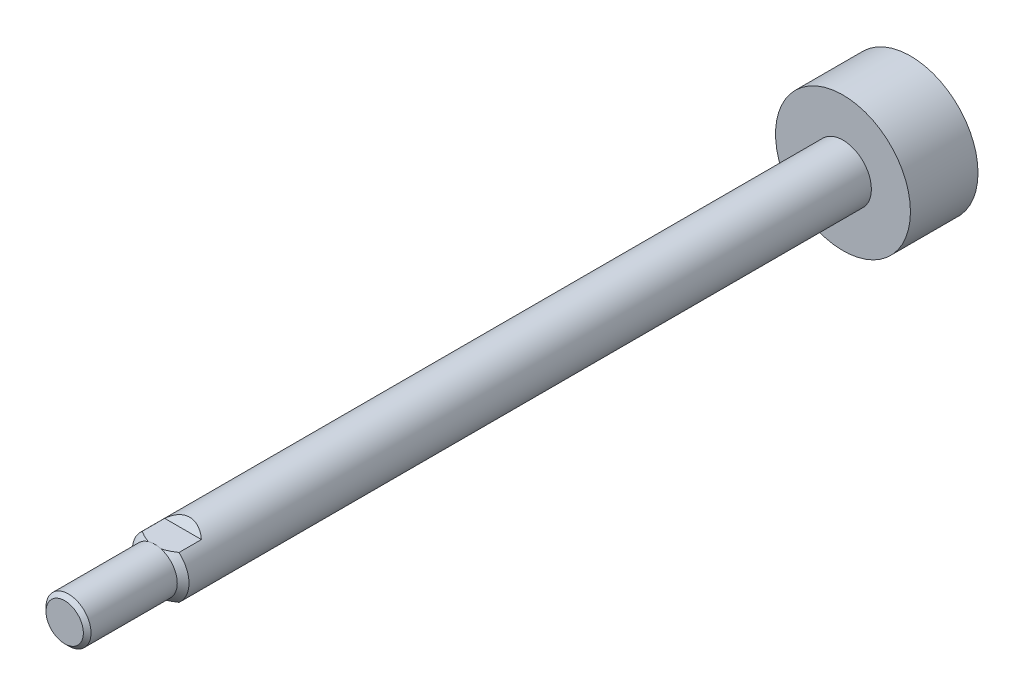
ISO-10303-21;
HEADER;
FILE_DESCRIPTION(('STEP AP214'),'2;1');
FILE_NAME('part.step','',(''),(''),'','','');
FILE_SCHEMA(('AUTOMOTIVE_DESIGN { 1 0 10303 214 1 1 1 1 }'));
ENDSEC;
DATA;
#1=APPLICATION_CONTEXT('core data for automotive mechanical design processes');
#2=APPLICATION_PROTOCOL_DEFINITION('international standard','automotive_design',2000,#1);
#3=PRODUCT_CONTEXT('',#1,'mechanical');
#4=PRODUCT('Part','Part','',(#3));
#5=PRODUCT_RELATED_PRODUCT_CATEGORY('part','',(#4));
#6=PRODUCT_DEFINITION_FORMATION('','',#4);
#7=PRODUCT_DEFINITION_CONTEXT('part definition',#1,'design');
#8=PRODUCT_DEFINITION('design','',#6,#7);
#9=PRODUCT_DEFINITION_SHAPE('','',#8);
#10=(LENGTH_UNIT() NAMED_UNIT(*) SI_UNIT(.MILLI.,.METRE.));
#11=(NAMED_UNIT(*) PLANE_ANGLE_UNIT() SI_UNIT($,.RADIAN.));
#12=(NAMED_UNIT(*) SI_UNIT($,.STERADIAN.) SOLID_ANGLE_UNIT());
#13=UNCERTAINTY_MEASURE_WITH_UNIT(LENGTH_MEASURE(1.E-05),#10,'distance_accuracy_value','');
#14=(GEOMETRIC_REPRESENTATION_CONTEXT(3) GLOBAL_UNCERTAINTY_ASSIGNED_CONTEXT((#13)) GLOBAL_UNIT_ASSIGNED_CONTEXT((#10,
#11,#12)) REPRESENTATION_CONTEXT('',''));
#15=CARTESIAN_POINT('',(0.,0.,0.));
#16=DIRECTION('',(0.,0.,1.));
#17=DIRECTION('',(1.,0.,0.));
#18=AXIS2_PLACEMENT_3D('',#15,#16,#17);
#19=CARTESIAN_POINT('',(0.,0.,12.7));
#20=DIRECTION('',(0.,0.,-1.));
#21=DIRECTION('',(-1.,0.,0.));
#22=AXIS2_PLACEMENT_3D('',#19,#20,#21);
#23=PLANE('',#22);
#24=CARTESIAN_POINT('',(0.,0.,12.6999999999384));
#25=DIRECTION('',(0.,0.,-1.));
#26=DIRECTION('',(-1.,0.,0.));
#27=AXIS2_PLACEMENT_3D('',#24,#25,#26);
#28=CIRCLE('',#27,2.63398000004145);
#29=CARTESIAN_POINT('',(-2.63398000004145,0.,12.6999999999384));
#30=VERTEX_POINT('',#29);
#31=EDGE_CURVE('E26',#30,#30,#28,.T.);
#32=ORIENTED_EDGE('',*,*,#31,.F.);
#33=EDGE_LOOP('',(#32));
#34=FACE_BOUND('',#33,.T.);
#35=ADVANCED_FACE('F23',(#34),#23,.F.);
#36=CARTESIAN_POINT('',(0.,9.5123,-106.57205));
#37=DIRECTION('',(0.,0.,1.));
#38=DIRECTION('',(1.,0.,0.));
#39=AXIS2_PLACEMENT_3D('',#36,#37,#38);
#40=PLANE('',#39);
#41=CARTESIAN_POINT('',(0.,0.,-106.57205));
#42=DIRECTION('',(0.,0.,1.));
#43=DIRECTION('',(1.,0.,0.));
#44=AXIS2_PLACEMENT_3D('',#41,#42,#43);
#45=CIRCLE('',#44,9.5123);
#46=CARTESIAN_POINT('',(9.5123,0.,-106.57205));
#47=VERTEX_POINT('',#46);
#48=EDGE_CURVE('E85',#47,#47,#45,.T.);
#49=ORIENTED_EDGE('',*,*,#48,.F.);
#50=EDGE_LOOP('',(#49));
#51=FACE_BOUND('',#50,.T.);
#52=ADVANCED_FACE('F214',(#51),#40,.F.);
#53=CARTESIAN_POINT('',(0.,0.,12.1589800000379));
#54=DIRECTION('',(0.,0.,-1.));
#55=DIRECTION('',(-1.,0.,0.));
#56=AXIS2_PLACEMENT_3D('',#53,#54,#55);
#57=CONICAL_SURFACE('',#56,3.17499999994197,0.785398163397448);
#58=ORIENTED_EDGE('',*,*,#31,.T.);
#59=EDGE_LOOP('',(#58));
#60=FACE_BOUND('',#59,.T.);
#61=CARTESIAN_POINT('',(0.,0.,12.15898));
#62=DIRECTION('',(0.,0.,1.));
#63=DIRECTION('',(1.,0.,0.));
#64=AXIS2_PLACEMENT_3D('',#61,#62,#63);
#65=CIRCLE('',#64,3.175);
#66=CARTESIAN_POINT('',(3.175,0.,12.15898));
#67=VERTEX_POINT('',#66);
#68=EDGE_CURVE('E84',#67,#67,#65,.F.);
#69=ORIENTED_EDGE('',*,*,#68,.F.);
#70=EDGE_LOOP('',(#69));
#71=FACE_BOUND('',#70,.T.);
#72=ADVANCED_FACE('F210',(#60,#71),#57,.T.);
#73=CARTESIAN_POINT('',(0.,0.,-106.57205));
#74=DIRECTION('',(0.,0.,1.));
#75=DIRECTION('',(1.,0.,0.));
#76=AXIS2_PLACEMENT_3D('',#73,#74,#75);
#77=CYLINDRICAL_SURFACE('',#76,9.5123);
#78=CARTESIAN_POINT('',(0.,0.,-97.04705));
#79=DIRECTION('',(0.,0.,1.));
#80=DIRECTION('',(1.,0.,0.));
#81=AXIS2_PLACEMENT_3D('',#78,#79,#80);
#82=CIRCLE('',#81,9.5123);
#83=CARTESIAN_POINT('',(9.5123,0.,-97.04705));
#84=VERTEX_POINT('',#83);
#85=EDGE_CURVE('E96',#84,#84,#82,.F.);
#86=ORIENTED_EDGE('',*,*,#85,.T.);
#87=EDGE_LOOP('',(#86));
#88=FACE_BOUND('',#87,.T.);
#89=ORIENTED_EDGE('',*,*,#48,.T.);
#90=EDGE_LOOP('',(#89));
#91=FACE_BOUND('',#90,.T.);
#92=ADVANCED_FACE('F222',(#88,#91),#77,.T.);
#93=CARTESIAN_POINT('',(8.001,6.096,0.));
#94=DIRECTION('',(0.,0.,-1.));
#95=DIRECTION('',(-1.,0.,0.));
#96=AXIS2_PLACEMENT_3D('',#93,#94,#95);
#97=PLANE('',#96);
#98=DIRECTION('',(1.,0.,0.));
#99=VECTOR('',#98,1.);
#100=CARTESIAN_POINT('',(8.001,3.048,0.));
#101=LINE('',#100,#99);
#102=CARTESIAN_POINT('',(-0.888999999997889,3.048,0.));
#103=VERTEX_POINT('',#102);
#104=CARTESIAN_POINT('',(0.888999999997889,3.048,0.));
#105=VERTEX_POINT('',#104);
#106=EDGE_CURVE('E98',#103,#105,#101,.T.);
#107=ORIENTED_EDGE('',*,*,#106,.F.);
#108=CARTESIAN_POINT('',(0.,0.,0.));
#109=DIRECTION('',(0.,0.,1.));
#110=DIRECTION('',(1.,0.,0.));
#111=AXIS2_PLACEMENT_3D('',#108,#109,#110);
#112=CIRCLE('',#111,3.175);
#113=EDGE_CURVE('E73',#105,#103,#112,.T.);
#114=ORIENTED_EDGE('',*,*,#113,.F.);
#115=EDGE_LOOP('',(#107,#114));
#116=FACE_BOUND('',#115,.T.);
#117=ADVANCED_FACE('F99',(#116),#97,.T.);
#118=CARTESIAN_POINT('',(0.,0.,-106.57205));
#119=DIRECTION('',(0.,0.,1.));
#120=DIRECTION('',(1.,0.,0.));
#121=AXIS2_PLACEMENT_3D('',#118,#119,#120);
#122=CYLINDRICAL_SURFACE('',#121,3.175);
#123=ORIENTED_EDGE('',*,*,#68,.T.);
#124=EDGE_LOOP('',(#123));
#125=FACE_BOUND('',#124,.T.);
#126=CARTESIAN_POINT('',(0.,0.,0.));
#127=DIRECTION('',(0.,0.,1.));
#128=DIRECTION('',(1.,0.,0.));
#129=AXIS2_PLACEMENT_3D('',#126,#127,#128);
#130=CIRCLE('',#129,3.175);
#131=CARTESIAN_POINT('',(0.888999999997889,-3.048,0.));
#132=VERTEX_POINT('',#131);
#133=CARTESIAN_POINT('',(-0.888999999997889,-3.048,0.));
#134=VERTEX_POINT('',#133);
#135=EDGE_CURVE('E185',#132,#134,#130,.F.);
#136=ORIENTED_EDGE('',*,*,#135,.F.);
#137=CARTESIAN_POINT('',(0.,0.,0.));
#138=DIRECTION('',(0.,0.,-1.));
#139=DIRECTION('',(-1.,0.,0.));
#140=AXIS2_PLACEMENT_3D('',#137,#138,#139);
#141=CIRCLE('',#140,3.17499999999882);
#142=EDGE_CURVE('E82',#105,#132,#141,.T.);
#143=ORIENTED_EDGE('',*,*,#142,.F.);
#144=ORIENTED_EDGE('',*,*,#113,.T.);
#145=CARTESIAN_POINT('',(0.,0.,0.));
#146=DIRECTION('',(0.,0.,-1.));
#147=DIRECTION('',(-1.,0.,0.));
#148=AXIS2_PLACEMENT_3D('',#145,#146,#147);
#149=CIRCLE('',#148,3.17499999999882);
#150=EDGE_CURVE('E79',#134,#103,#149,.T.);
#151=ORIENTED_EDGE('',*,*,#150,.F.);
#152=EDGE_LOOP('',(#136,#143,#144,#151));
#153=FACE_BOUND('',#152,.T.);
#154=ADVANCED_FACE('F78',(#125,#153),#122,.T.);
#155=CARTESIAN_POINT('',(8.001,-3.048,0.));
#156=DIRECTION('',(0.,0.,-1.));
#157=DIRECTION('',(-1.,0.,0.));
#158=AXIS2_PLACEMENT_3D('',#155,#156,#157);
#159=PLANE('',#158);
#160=ORIENTED_EDGE('',*,*,#135,.T.);
#161=DIRECTION('',(1.,0.,0.));
#162=VECTOR('',#161,1.);
#163=CARTESIAN_POINT('',(8.001,-3.048,0.));
#164=LINE('',#163,#162);
#165=EDGE_CURVE('E175',#132,#134,#164,.F.);
#166=ORIENTED_EDGE('',*,*,#165,.F.);
#167=EDGE_LOOP('',(#160,#166));
#168=FACE_BOUND('',#167,.T.);
#169=ADVANCED_FACE('F202',(#168),#159,.T.);
#170=CARTESIAN_POINT('',(0.,4.0005,-97.04705));
#171=DIRECTION('',(0.,0.,-1.));
#172=DIRECTION('',(-1.,0.,0.));
#173=AXIS2_PLACEMENT_3D('',#170,#171,#172);
#174=PLANE('',#173);
#175=CARTESIAN_POINT('',(0.,0.,-97.04705));
#176=DIRECTION('',(0.,0.,1.));
#177=DIRECTION('',(1.,0.,0.));
#178=AXIS2_PLACEMENT_3D('',#175,#176,#177);
#179=CIRCLE('',#178,4.0005);
#180=CARTESIAN_POINT('',(4.0005,0.,-97.04705));
#181=VERTEX_POINT('',#180);
#182=EDGE_CURVE('E169',#181,#181,#179,.T.);
#183=ORIENTED_EDGE('',*,*,#182,.F.);
#184=EDGE_LOOP('',(#183));
#185=FACE_BOUND('',#184,.T.);
#186=ORIENTED_EDGE('',*,*,#85,.F.);
#187=EDGE_LOOP('',(#186));
#188=FACE_BOUND('',#187,.T.);
#189=ADVANCED_FACE('F128',(#185,#188),#174,.F.);
#190=CARTESIAN_POINT('',(0.,0.,-0.825500000019019));
#191=DIRECTION('',(0.,0.,-1.));
#192=DIRECTION('',(-1.,0.,0.));
#193=AXIS2_PLACEMENT_3D('',#190,#191,#192);
#194=CONICAL_SURFACE('',#193,4.00050000001784,0.785398163397448);
#195=CARTESIAN_POINT('',(-2.59108013191357,3.048,-0.825500000000836));
#196=CARTESIAN_POINT('',(-2.5245787469383,3.048,-0.782433736000968));
#197=CARTESIAN_POINT('',(-2.45764287109544,3.048,-0.740035776470358));
#198=CARTESIAN_POINT('',(-2.32278153430408,3.048,-0.656813485671581));
#199=CARTESIAN_POINT('',(-2.25485586670252,3.048,-0.615989489701885));
#200=CARTESIAN_POINT('',(-2.05022582731277,3.048,-0.496710059814701));
#201=CARTESIAN_POINT('',(-1.91192257981661,3.048,-0.420957250699383));
#202=CARTESIAN_POINT('',(-1.62990348506685,3.048,-0.27927308894989));
#203=CARTESIAN_POINT('',(-1.48617716792997,3.048,-0.213362095160096));
#204=CARTESIAN_POINT('',(-1.2659833932071,3.048,-0.124770715665092));
#205=CARTESIAN_POINT('',(-1.19160952153923,3.048,-0.0968910890218909));
#206=CARTESIAN_POINT('',(-1.04139163330174,3.048,-0.0452202891908669));
#207=CARTESIAN_POINT('',(-0.965546455421188,3.048,-0.0214325050750028));
#208=CARTESIAN_POINT('',(-0.888999999999641,3.048,-1.07954948515557E-12));
#209=B_SPLINE_CURVE_WITH_KNOTS('',3,(#195,#196,#197,#198,#199,#200,#201,#202,#203,#204,#205,
#206,#207,#208),.UNSPECIFIED.,.F.,.F.,(4,2,2,2,2,2,4),(0.,0.237680636477149,0.475411628954728,
0.94819961586915,1.42195245524382,1.66012772015512,1.89849931388161),.UNSPECIFIED.);
#210=CARTESIAN_POINT('',(-2.59108013191384,3.048,-0.825500000000421));
#211=VERTEX_POINT('',#210);
#212=EDGE_CURVE('E91',#211,#103,#209,.T.);
#213=ORIENTED_EDGE('',*,*,#212,.F.);
#214=CARTESIAN_POINT('',(0.,0.,-0.825500000000007));
#215=DIRECTION('',(0.,0.,1.));
#216=DIRECTION('',(1.,0.,0.));
#217=AXIS2_PLACEMENT_3D('',#214,#215,#216);
#218=CIRCLE('',#217,4.0005);
#219=CARTESIAN_POINT('',(-2.59108013191384,-3.048,-0.825500000000421));
#220=VERTEX_POINT('',#219);
#221=EDGE_CURVE('E173',#220,#211,#218,.F.);
#222=ORIENTED_EDGE('',*,*,#221,.F.);
#223=CARTESIAN_POINT('',(-0.888999999999642,-3.048,-1.08192351982073E-12));
#224=CARTESIAN_POINT('',(-1.02251233905902,-3.048,-0.0374409701690382));
#225=CARTESIAN_POINT('',(-1.15377351574946,-3.048,-0.08190749576995));
#226=CARTESIAN_POINT('',(-1.41166914594608,-3.048,-0.181919877276082));
#227=CARTESIAN_POINT('',(-1.53831437114978,-3.048,-0.237437684987115));
#228=CARTESIAN_POINT('',(-1.78665081988931,-3.048,-0.356380332584577));
#229=CARTESIAN_POINT('',(-1.90837046213328,-3.048,-0.419747249329886));
#230=CARTESIAN_POINT('',(-2.14839989144078,-3.048,-0.552725124860477));
#231=CARTESIAN_POINT('',(-2.26670818994804,-3.048,-0.622338756537196));
#232=CARTESIAN_POINT('',(-2.41836334986857,-3.048,-0.715763216039787));
#233=CARTESIAN_POINT('',(-2.45305600946678,-3.048,-0.73742536639303));
#234=CARTESIAN_POINT('',(-2.5222313800877,-3.048,-0.78116412627651));
#235=CARTESIAN_POINT('',(-2.55671382520683,-3.048,-0.803241156468486));
#236=CARTESIAN_POINT('',(-2.59108013191357,-3.048,-0.825500000000836));
#237=B_SPLINE_CURVE_WITH_KNOTS('',3,(#223,#224,#225,#226,#227,#228,#229,#230,#231,#232,#233,
#234,#235,#236),.UNSPECIFIED.,.F.,.F.,(4,2,2,2,2,2,4),(0.,0.41540546194259,0.829769765595444,
1.24124050795268,1.65288816078483,1.77558793923406,1.89841967045774),.UNSPECIFIED.);
#238=EDGE_CURVE('E93',#134,#220,#237,.T.);
#239=ORIENTED_EDGE('',*,*,#238,.F.);
#240=ORIENTED_EDGE('',*,*,#150,.T.);
#241=EDGE_LOOP('',(#213,#222,#239,#240));
#242=FACE_BOUND('',#241,.T.);
#243=ADVANCED_FACE('F88',(#242),#194,.T.);
#244=CARTESIAN_POINT('',(8.001,3.048,-3.9878));
#245=DIRECTION('',(0.,0.707106781186548,0.707106781186547));
#246=DIRECTION('',(0.,-0.707106781186547,0.707106781186548));
#247=AXIS2_PLACEMENT_3D('',#244,#245,#246);
#248=PLANE('',#247);
#249=CARTESIAN_POINT('',(0.,0.,-0.939800000000005));
#250=DIRECTION('',(0.,0.707106781186548,0.707106781186547));
#251=DIRECTION('',(0.,-0.707106781186547,0.707106781186548));
#252=AXIS2_PLACEMENT_3D('',#249,#250,#251);
#253=ELLIPSE('',#252,5.65756135627357,4.0005);
#254=CARTESIAN_POINT('',(-2.5910801319141,3.048,-3.98779999999999));
#255=VERTEX_POINT('',#254);
#256=CARTESIAN_POINT('',(2.5910801319141,3.048,-3.98779999999999));
#257=VERTEX_POINT('',#256);
#258=EDGE_CURVE('E178',#255,#257,#253,.F.);
#259=ORIENTED_EDGE('',*,*,#258,.F.);
#260=DIRECTION('',(1.,0.,0.));
#261=VECTOR('',#260,1.);
#262=CARTESIAN_POINT('',(8.001,3.048,-3.9878));
#263=LINE('',#262,#261);
#264=EDGE_CURVE('E95',#257,#255,#263,.F.);
#265=ORIENTED_EDGE('',*,*,#264,.F.);
#266=EDGE_LOOP('',(#259,#265));
#267=FACE_BOUND('',#266,.T.);
#268=ADVANCED_FACE('F127',(#267),#248,.T.);
#269=CARTESIAN_POINT('',(8.001,3.048,0.));
#270=DIRECTION('',(0.,1.,0.));
#271=DIRECTION('',(0.,0.,1.));
#272=AXIS2_PLACEMENT_3D('',#269,#270,#271);
#273=PLANE('',#272);
#274=ORIENTED_EDGE('',*,*,#212,.T.);
#275=ORIENTED_EDGE('',*,*,#106,.T.);
#276=CARTESIAN_POINT('',(2.59108013191777,3.048,-0.825500000003559));
#277=CARTESIAN_POINT('',(2.52457874694235,3.048,-0.782433736003547));
#278=CARTESIAN_POINT('',(2.45764287109932,3.048,-0.740035776472795));
#279=CARTESIAN_POINT('',(2.32278153430765,3.048,-0.656813485673739));
#280=CARTESIAN_POINT('',(2.25485586670592,3.048,-0.615989489703904));
#281=CARTESIAN_POINT('',(2.05022582731567,3.048,-0.496710059816317));
#282=CARTESIAN_POINT('',(1.91192257981918,3.048,-0.420957250700739));
#283=CARTESIAN_POINT('',(1.62990348506873,3.048,-0.279273088950764));
#284=CARTESIAN_POINT('',(1.48617716793149,3.048,-0.213362095160746));
#285=CARTESIAN_POINT('',(1.26598339320805,3.048,-0.124770715665452));
#286=CARTESIAN_POINT('',(1.19160952153998,3.048,-0.0968910890221616));
#287=CARTESIAN_POINT('',(1.0413916333021,3.048,-0.0452202891909787));
#288=CARTESIAN_POINT('',(0.965546455421343,3.048,-0.0214325050750453));
#289=CARTESIAN_POINT('',(0.88899999999959,3.048,-1.0651448180133E-12));
#290=B_SPLINE_CURVE_WITH_KNOTS('',3,(#276,#277,#278,#279,#280,#281,#282,#283,#284,#285,#286,
#287,#288,#289),.UNSPECIFIED.,.F.,.F.,(4,2,2,2,2,2,4),(0.,0.237680636477783,0.475411628955996,
0.948199615871672,1.4219524552476,1.66012772015954,1.89849931388667),.UNSPECIFIED.);
#291=CARTESIAN_POINT('',(2.59108013191594,3.048,-0.825500000001783));
#292=VERTEX_POINT('',#291);
#293=EDGE_CURVE('E101',#292,#105,#290,.T.);
#294=ORIENTED_EDGE('',*,*,#293,.F.);
#295=DIRECTION('',(0.,0.,1.));
#296=VECTOR('',#295,1.);
#297=CARTESIAN_POINT('',(2.5910801319141,3.048,-106.57205));
#298=LINE('',#297,#296);
#299=EDGE_CURVE('E180',#257,#292,#298,.T.);
#300=ORIENTED_EDGE('',*,*,#299,.F.);
#301=ORIENTED_EDGE('',*,*,#264,.T.);
#302=DIRECTION('',(0.,0.,1.));
#303=VECTOR('',#302,1.);
#304=CARTESIAN_POINT('',(-2.5910801319141,3.048,-106.57205));
#305=LINE('',#304,#303);
#306=EDGE_CURVE('E105',#211,#255,#305,.F.);
#307=ORIENTED_EDGE('',*,*,#306,.F.);
#308=EDGE_LOOP('',(#274,#275,#294,#300,#301,#307));
#309=FACE_BOUND('',#308,.T.);
#310=ADVANCED_FACE('F103',(#309),#273,.T.);
#311=CARTESIAN_POINT('',(0.,0.,-0.825500000019019));
#312=DIRECTION('',(0.,0.,-1.));
#313=DIRECTION('',(-1.,0.,0.));
#314=AXIS2_PLACEMENT_3D('',#311,#312,#313);
#315=CONICAL_SURFACE('',#314,4.00050000001784,0.785398163397448);
#316=ORIENTED_EDGE('',*,*,#293,.T.);
#317=ORIENTED_EDGE('',*,*,#142,.T.);
#318=CARTESIAN_POINT('',(2.59108013191357,-3.048,-0.825500000000836));
#319=CARTESIAN_POINT('',(2.5245787469383,-3.048,-0.782433736000968));
#320=CARTESIAN_POINT('',(2.45764287109544,-3.048,-0.740035776470358));
#321=CARTESIAN_POINT('',(2.32278153430408,-3.048,-0.656813485671582));
#322=CARTESIAN_POINT('',(2.25485586670252,-3.048,-0.615989489701885));
#323=CARTESIAN_POINT('',(2.05022582731277,-3.048,-0.496710059814702));
#324=CARTESIAN_POINT('',(1.91192257981661,-3.048,-0.420957250699383));
#325=CARTESIAN_POINT('',(1.62990348506685,-3.048,-0.279273088949891));
#326=CARTESIAN_POINT('',(1.48617716792998,-3.048,-0.213362095160097));
#327=CARTESIAN_POINT('',(1.2659833932071,-3.048,-0.124770715665093));
#328=CARTESIAN_POINT('',(1.19160952153923,-3.048,-0.0968910890218918));
#329=CARTESIAN_POINT('',(1.04139163330174,-3.048,-0.0452202891908677));
#330=CARTESIAN_POINT('',(0.965546455421191,-3.048,-0.0214325050750036));
#331=CARTESIAN_POINT('',(0.888999999999644,-3.048,-1.08026498315054E-12));
#332=B_SPLINE_CURVE_WITH_KNOTS('',3,(#318,#319,#320,#321,#322,#323,#324,#325,#326,#327,#328,
#329,#330,#331),.UNSPECIFIED.,.F.,.F.,(4,2,2,2,2,2,4),(0.,0.237680636477149,0.475411628954728,
0.948199615869149,1.42195245524381,1.66012772015512,1.89849931388161),.UNSPECIFIED.);
#333=CARTESIAN_POINT('',(2.59108013191384,-3.048,-0.825500000000421));
#334=VERTEX_POINT('',#333);
#335=EDGE_CURVE('E136',#334,#132,#332,.T.);
#336=ORIENTED_EDGE('',*,*,#335,.F.);
#337=CARTESIAN_POINT('',(0.,0.,-0.825500000000007));
#338=DIRECTION('',(0.,0.,1.));
#339=DIRECTION('',(1.,0.,0.));
#340=AXIS2_PLACEMENT_3D('',#337,#338,#339);
#341=CIRCLE('',#340,4.0005);
#342=EDGE_CURVE('E189',#292,#334,#341,.F.);
#343=ORIENTED_EDGE('',*,*,#342,.F.);
#344=EDGE_LOOP('',(#316,#317,#336,#343));
#345=FACE_BOUND('',#344,.T.);
#346=ADVANCED_FACE('F146',(#345),#315,.T.);
#347=CARTESIAN_POINT('',(8.001,-3.048,-3.9878));
#348=DIRECTION('',(0.,-1.,0.));
#349=DIRECTION('',(0.,0.,-1.));
#350=AXIS2_PLACEMENT_3D('',#347,#348,#349);
#351=PLANE('',#350);
#352=ORIENTED_EDGE('',*,*,#335,.T.);
#353=ORIENTED_EDGE('',*,*,#165,.T.);
#354=ORIENTED_EDGE('',*,*,#238,.T.);
#355=DIRECTION('',(0.,0.,1.));
#356=VECTOR('',#355,1.);
#357=CARTESIAN_POINT('',(-2.5910801319141,-3.048,-106.57205));
#358=LINE('',#357,#356);
#359=CARTESIAN_POINT('',(-2.5910801319141,-3.048,-3.98779999999999));
#360=VERTEX_POINT('',#359);
#361=EDGE_CURVE('E171',#360,#220,#358,.T.);
#362=ORIENTED_EDGE('',*,*,#361,.F.);
#363=DIRECTION('',(1.,0.,0.));
#364=VECTOR('',#363,1.);
#365=CARTESIAN_POINT('',(8.001,-3.048,-3.9878));
#366=LINE('',#365,#364);
#367=CARTESIAN_POINT('',(2.5910801319141,-3.048,-3.98779999999999));
#368=VERTEX_POINT('',#367);
#369=EDGE_CURVE('E41',#368,#360,#366,.F.);
#370=ORIENTED_EDGE('',*,*,#369,.F.);
#371=DIRECTION('',(0.,0.,1.));
#372=VECTOR('',#371,1.);
#373=CARTESIAN_POINT('',(2.5910801319141,-3.048,-106.57205));
#374=LINE('',#373,#372);
#375=EDGE_CURVE('E32',#334,#368,#374,.F.);
#376=ORIENTED_EDGE('',*,*,#375,.F.);
#377=EDGE_LOOP('',(#352,#353,#354,#362,#370,#376));
#378=FACE_BOUND('',#377,.T.);
#379=ADVANCED_FACE('F141',(#378),#351,.T.);
#380=CARTESIAN_POINT('',(8.001,-6.096,-7.0358));
#381=DIRECTION('',(0.,-0.707106781186548,0.707106781186547));
#382=DIRECTION('',(0.,-0.707106781186547,-0.707106781186548));
#383=AXIS2_PLACEMENT_3D('',#380,#381,#382);
#384=PLANE('',#383);
#385=CARTESIAN_POINT('',(0.,0.,-0.939800000000005));
#386=DIRECTION('',(0.,-0.707106781186548,0.707106781186547));
#387=DIRECTION('',(0.,0.707106781186547,0.707106781186548));
#388=AXIS2_PLACEMENT_3D('',#385,#386,#387);
#389=ELLIPSE('',#388,5.65756135627357,4.0005);
#390=EDGE_CURVE('E13',#368,#360,#389,.F.);
#391=ORIENTED_EDGE('',*,*,#390,.F.);
#392=ORIENTED_EDGE('',*,*,#369,.T.);
#393=EDGE_LOOP('',(#391,#392));
#394=FACE_BOUND('',#393,.T.);
#395=ADVANCED_FACE('F145',(#394),#384,.T.);
#396=CARTESIAN_POINT('',(0.,0.,-106.57205));
#397=DIRECTION('',(0.,0.,1.));
#398=DIRECTION('',(1.,0.,0.));
#399=AXIS2_PLACEMENT_3D('',#396,#397,#398);
#400=CYLINDRICAL_SURFACE('',#399,4.0005);
#401=ORIENTED_EDGE('',*,*,#375,.T.);
#402=ORIENTED_EDGE('',*,*,#390,.T.);
#403=ORIENTED_EDGE('',*,*,#361,.T.);
#404=ORIENTED_EDGE('',*,*,#221,.T.);
#405=ORIENTED_EDGE('',*,*,#306,.T.);
#406=ORIENTED_EDGE('',*,*,#258,.T.);
#407=ORIENTED_EDGE('',*,*,#299,.T.);
#408=ORIENTED_EDGE('',*,*,#342,.T.);
#409=EDGE_LOOP('',(#401,#402,#403,#404,#405,#406,#407,#408));
#410=FACE_BOUND('',#409,.T.);
#411=ORIENTED_EDGE('',*,*,#182,.T.);
#412=EDGE_LOOP('',(#411));
#413=FACE_BOUND('',#412,.T.);
#414=ADVANCED_FACE('F157',(#410,#413),#400,.T.);
#415=CLOSED_SHELL('',(#35,#52,#72,#92,#117,#154,#169,#189,#243,#268,#310,#346,#379,#395,#414));
#416=MANIFOLD_SOLID_BREP('B1',#415);
#417=ADVANCED_BREP_SHAPE_REPRESENTATION('',(#18,#416),#14);
#418=SHAPE_DEFINITION_REPRESENTATION(#9,#417);
ENDSEC;
END-ISO-10303-21;
